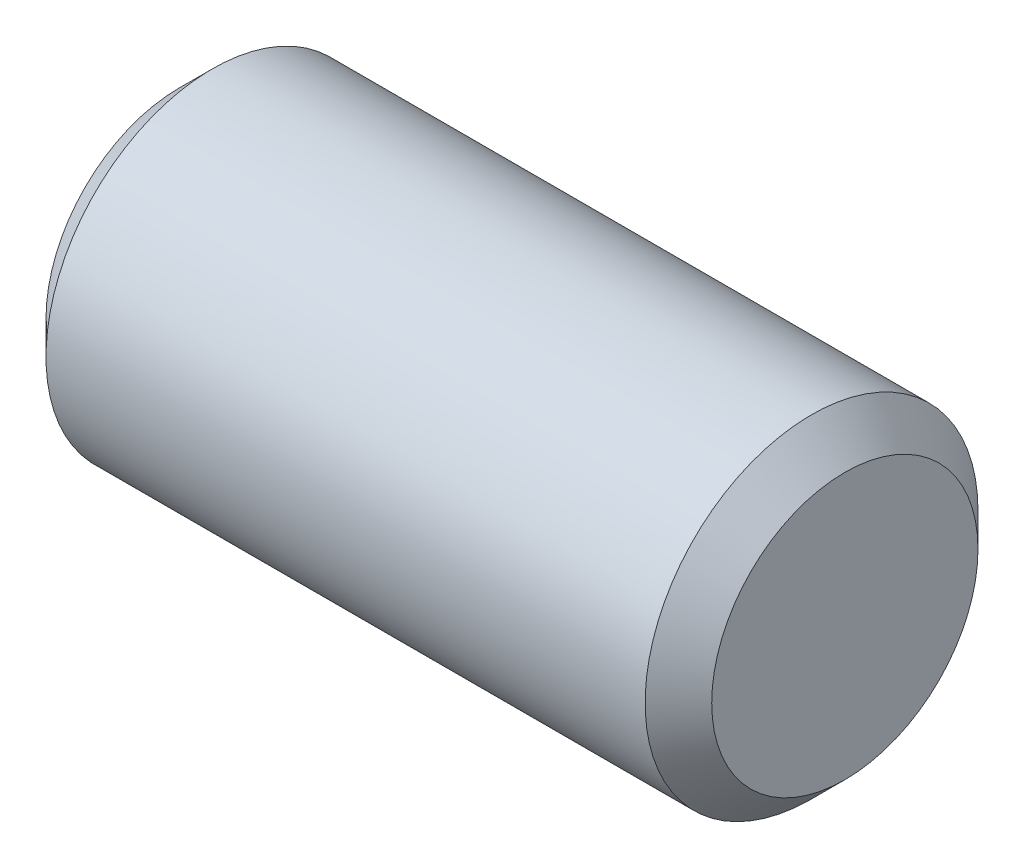
ISO-10303-21;
HEADER;
FILE_DESCRIPTION(('STEP AP214'),'2;1');
FILE_NAME('part.step','',(''),(''),'','','');
FILE_SCHEMA(('AUTOMOTIVE_DESIGN { 1 0 10303 214 1 1 1 1 }'));
ENDSEC;
DATA;
#1=APPLICATION_CONTEXT('core data for automotive mechanical design processes');
#2=APPLICATION_PROTOCOL_DEFINITION('international standard','automotive_design',2000,#1);
#3=PRODUCT_CONTEXT('',#1,'mechanical');
#4=PRODUCT('Part','Part','',(#3));
#5=PRODUCT_RELATED_PRODUCT_CATEGORY('part','',(#4));
#6=PRODUCT_DEFINITION_FORMATION('','',#4);
#7=PRODUCT_DEFINITION_CONTEXT('part definition',#1,'design');
#8=PRODUCT_DEFINITION('design','',#6,#7);
#9=PRODUCT_DEFINITION_SHAPE('','',#8);
#10=(LENGTH_UNIT() NAMED_UNIT(*) SI_UNIT(.MILLI.,.METRE.));
#11=(NAMED_UNIT(*) PLANE_ANGLE_UNIT() SI_UNIT($,.RADIAN.));
#12=(NAMED_UNIT(*) SI_UNIT($,.STERADIAN.) SOLID_ANGLE_UNIT());
#13=UNCERTAINTY_MEASURE_WITH_UNIT(LENGTH_MEASURE(1.E-05),#10,'distance_accuracy_value','');
#14=(GEOMETRIC_REPRESENTATION_CONTEXT(3) GLOBAL_UNCERTAINTY_ASSIGNED_CONTEXT((#13)) GLOBAL_UNIT_ASSIGNED_CONTEXT((#10,
#11,#12)) REPRESENTATION_CONTEXT('',''));
#15=CARTESIAN_POINT('',(0.,0.,0.));
#16=DIRECTION('',(0.,0.,1.));
#17=DIRECTION('',(1.,0.,0.));
#18=AXIS2_PLACEMENT_3D('',#15,#16,#17);
#19=CARTESIAN_POINT('',(-3.175,0.,0.));
#20=DIRECTION('',(1.,0.,0.));
#21=DIRECTION('',(0.,0.,-1.));
#22=AXIS2_PLACEMENT_3D('',#19,#20,#21);
#23=CYLINDRICAL_SURFACE('',#22,1.5875);
#24=CARTESIAN_POINT('',(2.8575,0.,0.));
#25=DIRECTION('',(1.,0.,0.));
#26=DIRECTION('',(0.,0.,-1.));
#27=AXIS2_PLACEMENT_3D('',#24,#25,#26);
#28=CIRCLE('',#27,1.5875);
#29=CARTESIAN_POINT('',(2.8575,0.,-1.5875));
#30=VERTEX_POINT('',#29);
#31=EDGE_CURVE('E40',#30,#30,#28,.F.);
#32=ORIENTED_EDGE('',*,*,#31,.T.);
#33=EDGE_LOOP('',(#32));
#34=FACE_BOUND('',#33,.T.);
#35=CARTESIAN_POINT('',(-2.8575,0.,0.));
#36=DIRECTION('',(1.,0.,0.));
#37=DIRECTION('',(0.,0.,-1.));
#38=AXIS2_PLACEMENT_3D('',#35,#36,#37);
#39=CIRCLE('',#38,1.5875);
#40=CARTESIAN_POINT('',(-2.8575,0.,-1.5875));
#41=VERTEX_POINT('',#40);
#42=EDGE_CURVE('E44',#41,#41,#39,.T.);
#43=ORIENTED_EDGE('',*,*,#42,.T.);
#44=EDGE_LOOP('',(#43));
#45=FACE_BOUND('',#44,.T.);
#46=ADVANCED_FACE('F33',(#34,#45),#23,.T.);
#47=CARTESIAN_POINT('',(-3.175,0.,0.));
#48=DIRECTION('',(1.,0.,0.));
#49=DIRECTION('',(0.,0.,-1.));
#50=AXIS2_PLACEMENT_3D('',#47,#48,#49);
#51=PLANE('',#50);
#52=CARTESIAN_POINT('',(-3.175,0.,0.));
#53=DIRECTION('',(1.,0.,0.));
#54=DIRECTION('',(0.,0.,-1.));
#55=AXIS2_PLACEMENT_3D('',#52,#53,#54);
#56=CIRCLE('',#55,1.27);
#57=CARTESIAN_POINT('',(-3.175,0.,-1.27));
#58=VERTEX_POINT('',#57);
#59=EDGE_CURVE('E10',#58,#58,#56,.F.);
#60=ORIENTED_EDGE('',*,*,#59,.T.);
#61=EDGE_LOOP('',(#60));
#62=FACE_BOUND('',#61,.T.);
#63=ADVANCED_FACE('F64',(#62),#51,.F.);
#64=CARTESIAN_POINT('',(3.175,0.,0.));
#65=DIRECTION('',(1.,0.,0.));
#66=DIRECTION('',(0.,0.,-1.));
#67=AXIS2_PLACEMENT_3D('',#64,#65,#66);
#68=PLANE('',#67);
#69=CARTESIAN_POINT('',(3.175,0.,0.));
#70=DIRECTION('',(1.,0.,0.));
#71=DIRECTION('',(0.,0.,-1.));
#72=AXIS2_PLACEMENT_3D('',#69,#70,#71);
#73=CIRCLE('',#72,1.27);
#74=CARTESIAN_POINT('',(3.175,0.,-1.27));
#75=VERTEX_POINT('',#74);
#76=EDGE_CURVE('E48',#75,#75,#73,.T.);
#77=ORIENTED_EDGE('',*,*,#76,.T.);
#78=EDGE_LOOP('',(#77));
#79=FACE_BOUND('',#78,.T.);
#80=ADVANCED_FACE('F54',(#79),#68,.T.);
#81=CARTESIAN_POINT('',(3.175,0.,0.));
#82=DIRECTION('',(-1.,0.,0.));
#83=DIRECTION('',(0.,0.,1.));
#84=AXIS2_PLACEMENT_3D('',#81,#82,#83);
#85=CONICAL_SURFACE('',#84,1.27,0.785398163397448);
#86=ORIENTED_EDGE('',*,*,#31,.F.);
#87=EDGE_LOOP('',(#86));
#88=FACE_BOUND('',#87,.T.);
#89=ORIENTED_EDGE('',*,*,#76,.F.);
#90=EDGE_LOOP('',(#89));
#91=FACE_BOUND('',#90,.T.);
#92=ADVANCED_FACE('F56',(#88,#91),#85,.T.);
#93=CARTESIAN_POINT('',(-2.8575,0.,0.));
#94=DIRECTION('',(1.,0.,0.));
#95=DIRECTION('',(0.,0.,-1.));
#96=AXIS2_PLACEMENT_3D('',#93,#94,#95);
#97=CONICAL_SURFACE('',#96,1.5875,0.78539816339745);
#98=ORIENTED_EDGE('',*,*,#59,.F.);
#99=EDGE_LOOP('',(#98));
#100=FACE_BOUND('',#99,.T.);
#101=ORIENTED_EDGE('',*,*,#42,.F.);
#102=EDGE_LOOP('',(#101));
#103=FACE_BOUND('',#102,.T.);
#104=ADVANCED_FACE('F35',(#100,#103),#97,.T.);
#105=CLOSED_SHELL('',(#46,#63,#80,#92,#104));
#106=MANIFOLD_SOLID_BREP('B2',#105);
#107=ADVANCED_BREP_SHAPE_REPRESENTATION('',(#18,#106),#14);
#108=SHAPE_DEFINITION_REPRESENTATION(#9,#107);
ENDSEC;
END-ISO-10303-21;
